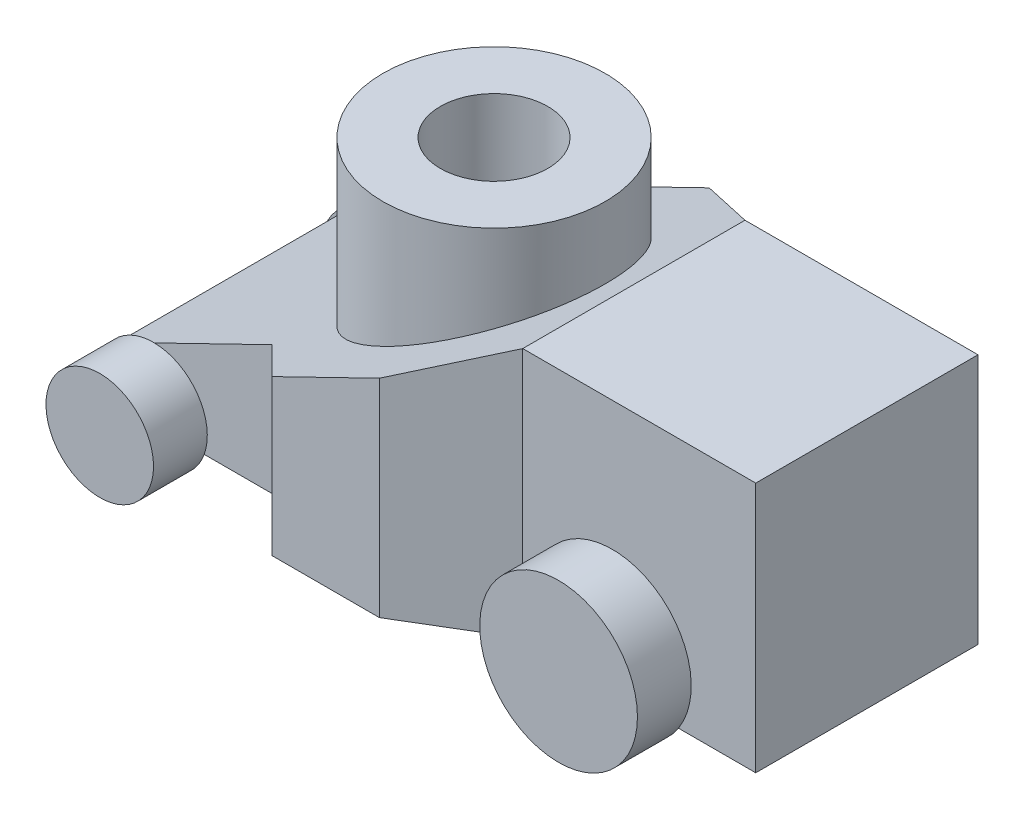
ISO-10303-21;
HEADER;
FILE_DESCRIPTION(('STEP AP214'),'2;1');
FILE_NAME('part.step','',(''),(''),'','','');
FILE_SCHEMA(('AUTOMOTIVE_DESIGN { 1 0 10303 214 1 1 1 1 }'));
ENDSEC;
DATA;
#1=APPLICATION_CONTEXT('core data for automotive mechanical design processes');
#2=APPLICATION_PROTOCOL_DEFINITION('international standard','automotive_design',2000,#1);
#3=PRODUCT_CONTEXT('',#1,'mechanical');
#4=PRODUCT('Part','Part','',(#3));
#5=PRODUCT_RELATED_PRODUCT_CATEGORY('part','',(#4));
#6=PRODUCT_DEFINITION_FORMATION('','',#4);
#7=PRODUCT_DEFINITION_CONTEXT('part definition',#1,'design');
#8=PRODUCT_DEFINITION('design','',#6,#7);
#9=PRODUCT_DEFINITION_SHAPE('','',#8);
#10=(LENGTH_UNIT() NAMED_UNIT(*) SI_UNIT(.MILLI.,.METRE.));
#11=(NAMED_UNIT(*) PLANE_ANGLE_UNIT() SI_UNIT($,.RADIAN.));
#12=(NAMED_UNIT(*) SI_UNIT($,.STERADIAN.) SOLID_ANGLE_UNIT());
#13=UNCERTAINTY_MEASURE_WITH_UNIT(LENGTH_MEASURE(1.E-05),#10,'distance_accuracy_value','');
#14=(GEOMETRIC_REPRESENTATION_CONTEXT(3) GLOBAL_UNCERTAINTY_ASSIGNED_CONTEXT((#13)) GLOBAL_UNIT_ASSIGNED_CONTEXT((#10,
#11,#12)) REPRESENTATION_CONTEXT('',''));
#15=CARTESIAN_POINT('',(0.,0.,0.));
#16=DIRECTION('',(0.,0.,1.));
#17=DIRECTION('',(1.,0.,0.));
#18=AXIS2_PLACEMENT_3D('',#15,#16,#17);
#19=CARTESIAN_POINT('',(178.,70.,31.));
#20=DIRECTION('',(0.,0.,-1.));
#21=DIRECTION('',(-1.,0.,0.));
#22=AXIS2_PLACEMENT_3D('',#19,#20,#21);
#23=PLANE('',#22);
#24=CARTESIAN_POINT('',(138.,12.,31.));
#25=DIRECTION('',(0.,0.,1.));
#26=DIRECTION('',(1.,0.,0.));
#27=AXIS2_PLACEMENT_3D('',#24,#25,#26);
#28=CIRCLE('',#27,22.);
#29=CARTESIAN_POINT('',(156.439088914586,0.,31.));
#30=VERTEX_POINT('',#29);
#31=CARTESIAN_POINT('',(119.560911085414,0.,31.));
#32=VERTEX_POINT('',#31);
#33=EDGE_CURVE('E180',#30,#32,#28,.T.);
#34=ORIENTED_EDGE('',*,*,#33,.F.);
#35=DIRECTION('',(1.,0.,0.));
#36=VECTOR('',#35,1.);
#37=CARTESIAN_POINT('',(178.,0.,31.));
#38=LINE('',#37,#36);
#39=CARTESIAN_POINT('',(178.,0.,31.));
#40=VERTEX_POINT('',#39);
#41=EDGE_CURVE('E256',#30,#40,#38,.T.);
#42=ORIENTED_EDGE('',*,*,#41,.T.);
#43=DIRECTION('',(0.,-1.,0.));
#44=VECTOR('',#43,1.);
#45=CARTESIAN_POINT('',(178.,70.,31.));
#46=LINE('',#45,#44);
#47=CARTESIAN_POINT('',(178.,70.,31.));
#48=VERTEX_POINT('',#47);
#49=EDGE_CURVE('E263',#48,#40,#46,.T.);
#50=ORIENTED_EDGE('',*,*,#49,.F.);
#51=DIRECTION('',(1.,0.,0.));
#52=VECTOR('',#51,1.);
#53=CARTESIAN_POINT('',(178.,70.,31.));
#54=LINE('',#53,#52);
#55=CARTESIAN_POINT('',(113.,70.,31.));
#56=VERTEX_POINT('',#55);
#57=EDGE_CURVE('E226',#56,#48,#54,.T.);
#58=ORIENTED_EDGE('',*,*,#57,.F.);
#59=DIRECTION('',(0.,-1.,0.));
#60=VECTOR('',#59,1.);
#61=CARTESIAN_POINT('',(113.,70.,31.));
#62=LINE('',#61,#60);
#63=CARTESIAN_POINT('',(113.,0.,31.));
#64=VERTEX_POINT('',#63);
#65=EDGE_CURVE('E266',#56,#64,#62,.T.);
#66=ORIENTED_EDGE('',*,*,#65,.T.);
#67=EDGE_CURVE('E257',#64,#32,#38,.T.);
#68=ORIENTED_EDGE('',*,*,#67,.T.);
#69=EDGE_LOOP('',(#34,#42,#50,#58,#66,#68));
#70=FACE_BOUND('',#69,.T.);
#71=ADVANCED_FACE('F31',(#70),#23,.F.);
#72=CARTESIAN_POINT('',(43.,70.,31.));
#73=DIRECTION('',(0.,0.,-1.));
#74=DIRECTION('',(-1.,0.,0.));
#75=AXIS2_PLACEMENT_3D('',#72,#73,#74);
#76=PLANE('',#75);
#77=CARTESIAN_POINT('',(10.,5.,31.));
#78=DIRECTION('',(0.,0.,1.));
#79=DIRECTION('',(1.,0.,0.));
#80=AXIS2_PLACEMENT_3D('',#77,#78,#79);
#81=CIRCLE('',#80,15.);
#82=CARTESIAN_POINT('',(24.142135623731,0.,31.));
#83=VERTEX_POINT('',#82);
#84=CARTESIAN_POINT('',(10.2678148206377,19.9976089834962,31.));
#85=VERTEX_POINT('',#84);
#86=EDGE_CURVE('E184',#83,#85,#81,.T.);
#87=ORIENTED_EDGE('',*,*,#86,.F.);
#88=DIRECTION('',(1.,0.,0.));
#89=VECTOR('',#88,1.);
#90=CARTESIAN_POINT('',(43.,0.,31.));
#91=LINE('',#90,#89);
#92=CARTESIAN_POINT('',(43.,0.,31.));
#93=VERTEX_POINT('',#92);
#94=EDGE_CURVE('E244',#83,#93,#91,.T.);
#95=ORIENTED_EDGE('',*,*,#94,.T.);
#96=DIRECTION('',(0.,-1.,0.));
#97=VECTOR('',#96,1.);
#98=CARTESIAN_POINT('',(43.,70.,31.));
#99=LINE('',#98,#97);
#100=CARTESIAN_POINT('',(43.,35.929203539823,31.));
#101=VERTEX_POINT('',#100);
#102=EDGE_CURVE('E273',#101,#93,#99,.T.);
#103=ORIENTED_EDGE('',*,*,#102,.F.);
#104=DIRECTION('',(0.899150472102885,0.437639610315564,0.));
#105=VECTOR('',#104,1.);
#106=CARTESIAN_POINT('',(56.4069899962011,42.4547296441687,31.));
#107=LINE('',#106,#105);
#108=EDGE_CURVE('E212',#85,#101,#107,.T.);
#109=ORIENTED_EDGE('',*,*,#108,.F.);
#110=EDGE_LOOP('',(#87,#95,#103,#109));
#111=FACE_BOUND('',#110,.T.);
#112=ADVANCED_FACE('F332',(#111),#76,.F.);
#113=CARTESIAN_POINT('',(113.,70.,101.));
#114=DIRECTION('',(-0.437639610315564,0.899150472102885,0.));
#115=DIRECTION('',(-0.899150472102885,-0.437639610315564,0.));
#116=AXIS2_PLACEMENT_3D('',#113,#114,#115);
#117=PLANE('',#116);
#118=DIRECTION('',(-0.791335930098313,-0.385163505800064,-0.474801558058988));
#119=VECTOR('',#118,1.);
#120=CARTESIAN_POINT('',(113.,70.,-31.));
#121=LINE('',#120,#119);
#122=CARTESIAN_POINT('',(113.,70.,-31.));
#123=VERTEX_POINT('',#122);
#124=CARTESIAN_POINT('',(88.,57.8318584070797,-46.));
#125=VERTEX_POINT('',#124);
#126=EDGE_CURVE('E154',#123,#125,#121,.T.);
#127=ORIENTED_EDGE('',*,*,#126,.T.);
#128=DIRECTION('',(-0.899150472102885,-0.437639610315564,0.));
#129=VECTOR('',#128,1.);
#130=CARTESIAN_POINT('',(92.7882107129289,60.162403444346,-46.));
#131=LINE('',#130,#129);
#132=CARTESIAN_POINT('',(58.,43.2300884955752,-46.));
#133=VERTEX_POINT('',#132);
#134=EDGE_CURVE('E220',#125,#133,#131,.T.);
#135=ORIENTED_EDGE('',*,*,#134,.T.);
#136=DIRECTION('',(-0.668615643572041,-0.325432392889047,0.668615643572041));
#137=VECTOR('',#136,1.);
#138=CARTESIAN_POINT('',(63.824843328782,46.0651892308231,-51.824843328782));
#139=LINE('',#138,#137);
#140=CARTESIAN_POINT('',(43.,35.929203539823,-31.));
#141=VERTEX_POINT('',#140);
#142=EDGE_CURVE('E218',#133,#141,#139,.T.);
#143=ORIENTED_EDGE('',*,*,#142,.T.);
#144=DIRECTION('',(-0.899150472102885,-0.437639610315564,0.));
#145=VECTOR('',#144,1.);
#146=CARTESIAN_POINT('',(56.4069899962011,42.4547296441687,-31.));
#147=LINE('',#146,#145);
#148=CARTESIAN_POINT('',(10.2678148206377,19.9976089834962,-31.));
#149=VERTEX_POINT('',#148);
#150=EDGE_CURVE('E216',#141,#149,#147,.T.);
#151=ORIENTED_EDGE('',*,*,#150,.T.);
#152=DIRECTION('',(-0.899150472102885,-0.437639610315564,0.));
#153=VECTOR('',#152,1.);
#154=CARTESIAN_POINT('',(113.,70.,-31.));
#155=LINE('',#154,#153);
#156=CARTESIAN_POINT('',(0.,15.,-31.));
#157=VERTEX_POINT('',#156);
#158=EDGE_CURVE('E175',#149,#157,#155,.T.);
#159=ORIENTED_EDGE('',*,*,#158,.T.);
#160=DIRECTION('',(0.,0.,-1.));
#161=VECTOR('',#160,1.);
#162=CARTESIAN_POINT('',(0.,15.,101.));
#163=LINE('',#162,#161);
#164=CARTESIAN_POINT('',(0.,15.,31.));
#165=VERTEX_POINT('',#164);
#166=EDGE_CURVE('E203',#165,#157,#163,.T.);
#167=ORIENTED_EDGE('',*,*,#166,.F.);
#168=EDGE_CURVE('E213',#165,#85,#107,.T.);
#169=ORIENTED_EDGE('',*,*,#168,.T.);
#170=ORIENTED_EDGE('',*,*,#108,.T.);
#171=DIRECTION('',(0.668615643572041,0.325432392889047,0.668615643572041));
#172=VECTOR('',#171,1.);
#173=CARTESIAN_POINT('',(63.824843328782,46.0651892308231,51.824843328782));
#174=LINE('',#173,#172);
#175=CARTESIAN_POINT('',(58.,43.2300884955752,46.));
#176=VERTEX_POINT('',#175);
#177=EDGE_CURVE('E210',#101,#176,#174,.T.);
#178=ORIENTED_EDGE('',*,*,#177,.T.);
#179=DIRECTION('',(0.899150472102885,0.437639610315564,0.));
#180=VECTOR('',#179,1.);
#181=CARTESIAN_POINT('',(92.7882107129289,60.162403444346,46.));
#182=LINE('',#181,#180);
#183=CARTESIAN_POINT('',(88.,57.8318584070797,46.));
#184=VERTEX_POINT('',#183);
#185=EDGE_CURVE('E208',#176,#184,#182,.T.);
#186=ORIENTED_EDGE('',*,*,#185,.T.);
#187=DIRECTION('',(0.791335930098313,0.385163505800064,-0.474801558058988));
#188=VECTOR('',#187,1.);
#189=CARTESIAN_POINT('',(113.,70.,31.));
#190=LINE('',#189,#188);
#191=EDGE_CURVE('E206',#184,#56,#190,.T.);
#192=ORIENTED_EDGE('',*,*,#191,.T.);
#193=DIRECTION('',(0.,0.,-1.));
#194=VECTOR('',#193,1.);
#195=CARTESIAN_POINT('',(113.,70.,-31.));
#196=LINE('',#195,#194);
#197=EDGE_CURVE('E11',#56,#123,#196,.T.);
#198=ORIENTED_EDGE('',*,*,#197,.T.);
#199=EDGE_LOOP('',(#127,#135,#143,#151,#159,#167,#169,#170,#178,#186,#192,#198));
#200=FACE_BOUND('',#199,.T.);
#201=CARTESIAN_POINT('',(74.,51.0176991150443,0.));
#202=DIRECTION('',(-0.437639610315564,0.899150472102885,0.));
#203=DIRECTION('',(-0.899150472102885,-0.437639610315564,0.));
#204=AXIS2_PLACEMENT_3D('',#201,#202,#203);
#205=ELLIPSE('',#204,34.4769879589773,31.);
#206=CARTESIAN_POINT('',(43.,35.929203539823,0.));
#207=VERTEX_POINT('',#206);
#208=EDGE_CURVE('E35',#207,#207,#205,.F.);
#209=ORIENTED_EDGE('',*,*,#208,.T.);
#210=EDGE_LOOP('',(#209));
#211=FACE_BOUND('',#210,.T.);
#212=ADVANCED_FACE('F337',(#200,#211),#117,.T.);
#213=CARTESIAN_POINT('',(113.,70.,-31.));
#214=DIRECTION('',(-0.514495755427527,0.,0.857492925712544));
#215=DIRECTION('',(0.857492925712544,0.,0.514495755427527));
#216=AXIS2_PLACEMENT_3D('',#213,#214,#215);
#217=PLANE('',#216);
#218=ORIENTED_EDGE('',*,*,#126,.F.);
#219=DIRECTION('',(0.,-1.,0.));
#220=VECTOR('',#219,1.);
#221=CARTESIAN_POINT('',(113.,70.,-31.));
#222=LINE('',#221,#220);
#223=CARTESIAN_POINT('',(113.,0.,-31.));
#224=VERTEX_POINT('',#223);
#225=EDGE_CURVE('E40',#123,#224,#222,.T.);
#226=ORIENTED_EDGE('',*,*,#225,.T.);
#227=DIRECTION('',(-0.857492925712544,0.,-0.514495755427527));
#228=VECTOR('',#227,1.);
#229=CARTESIAN_POINT('',(113.,0.,-31.));
#230=LINE('',#229,#228);
#231=CARTESIAN_POINT('',(88.,0.,-46.));
#232=VERTEX_POINT('',#231);
#233=EDGE_CURVE('E150',#224,#232,#230,.T.);
#234=ORIENTED_EDGE('',*,*,#233,.T.);
#235=DIRECTION('',(0.,-1.,0.));
#236=VECTOR('',#235,1.);
#237=CARTESIAN_POINT('',(88.,70.,-46.));
#238=LINE('',#237,#236);
#239=EDGE_CURVE('E286',#125,#232,#238,.T.);
#240=ORIENTED_EDGE('',*,*,#239,.F.);
#241=EDGE_LOOP('',(#218,#226,#234,#240));
#242=FACE_BOUND('',#241,.T.);
#243=ADVANCED_FACE('F290',(#242),#217,.F.);
#244=CARTESIAN_POINT('',(88.,70.,-46.));
#245=DIRECTION('',(0.,0.,1.));
#246=DIRECTION('',(1.,0.,0.));
#247=AXIS2_PLACEMENT_3D('',#244,#245,#246);
#248=PLANE('',#247);
#249=ORIENTED_EDGE('',*,*,#134,.F.);
#250=ORIENTED_EDGE('',*,*,#239,.T.);
#251=DIRECTION('',(-1.,0.,0.));
#252=VECTOR('',#251,1.);
#253=CARTESIAN_POINT('',(88.,0.,-46.));
#254=LINE('',#253,#252);
#255=CARTESIAN_POINT('',(58.,0.,-46.));
#256=VERTEX_POINT('',#255);
#257=EDGE_CURVE('E233',#232,#256,#254,.T.);
#258=ORIENTED_EDGE('',*,*,#257,.T.);
#259=DIRECTION('',(0.,-1.,0.));
#260=VECTOR('',#259,1.);
#261=CARTESIAN_POINT('',(58.,70.,-46.));
#262=LINE('',#261,#260);
#263=EDGE_CURVE('E284',#133,#256,#262,.T.);
#264=ORIENTED_EDGE('',*,*,#263,.F.);
#265=EDGE_LOOP('',(#249,#250,#258,#264));
#266=FACE_BOUND('',#265,.T.);
#267=ADVANCED_FACE('F365',(#266),#248,.F.);
#268=CARTESIAN_POINT('',(58.,70.,-46.));
#269=DIRECTION('',(0.707106781186548,0.,0.707106781186548));
#270=DIRECTION('',(0.707106781186548,0.,-0.707106781186548));
#271=AXIS2_PLACEMENT_3D('',#268,#269,#270);
#272=PLANE('',#271);
#273=ORIENTED_EDGE('',*,*,#142,.F.);
#274=ORIENTED_EDGE('',*,*,#263,.T.);
#275=DIRECTION('',(-0.707106781186547,0.,0.707106781186547));
#276=VECTOR('',#275,1.);
#277=CARTESIAN_POINT('',(58.,0.,-46.));
#278=LINE('',#277,#276);
#279=CARTESIAN_POINT('',(43.,0.,-31.));
#280=VERTEX_POINT('',#279);
#281=EDGE_CURVE('E236',#256,#280,#278,.T.);
#282=ORIENTED_EDGE('',*,*,#281,.T.);
#283=DIRECTION('',(0.,-1.,0.));
#284=VECTOR('',#283,1.);
#285=CARTESIAN_POINT('',(43.,70.,-31.));
#286=LINE('',#285,#284);
#287=EDGE_CURVE('E282',#141,#280,#286,.T.);
#288=ORIENTED_EDGE('',*,*,#287,.F.);
#289=EDGE_LOOP('',(#273,#274,#282,#288));
#290=FACE_BOUND('',#289,.T.);
#291=ADVANCED_FACE('F362',(#290),#272,.F.);
#292=CARTESIAN_POINT('',(43.,70.,-31.));
#293=DIRECTION('',(0.,0.,1.));
#294=DIRECTION('',(1.,0.,0.));
#295=AXIS2_PLACEMENT_3D('',#292,#293,#294);
#296=PLANE('',#295);
#297=DIRECTION('',(-1.,0.,0.));
#298=VECTOR('',#297,1.);
#299=CARTESIAN_POINT('',(43.,0.,-31.));
#300=LINE('',#299,#298);
#301=CARTESIAN_POINT('',(24.142135623731,0.,-31.));
#302=VERTEX_POINT('',#301);
#303=EDGE_CURVE('E240',#280,#302,#300,.T.);
#304=ORIENTED_EDGE('',*,*,#303,.T.);
#305=CARTESIAN_POINT('',(10.,5.,-31.));
#306=DIRECTION('',(0.,0.,1.));
#307=DIRECTION('',(1.,0.,0.));
#308=AXIS2_PLACEMENT_3D('',#305,#306,#307);
#309=CIRCLE('',#308,15.);
#310=EDGE_CURVE('E55',#302,#149,#309,.T.);
#311=ORIENTED_EDGE('',*,*,#310,.T.);
#312=ORIENTED_EDGE('',*,*,#150,.F.);
#313=ORIENTED_EDGE('',*,*,#287,.T.);
#314=EDGE_LOOP('',(#304,#311,#312,#313));
#315=FACE_BOUND('',#314,.T.);
#316=ADVANCED_FACE('F358',(#315),#296,.F.);
#317=CARTESIAN_POINT('',(0.,70.,31.));
#318=DIRECTION('',(1.,0.,0.));
#319=DIRECTION('',(0.,0.,-1.));
#320=AXIS2_PLACEMENT_3D('',#317,#318,#319);
#321=PLANE('',#320);
#322=ORIENTED_EDGE('',*,*,#166,.T.);
#323=DIRECTION('',(0.,-1.,0.));
#324=VECTOR('',#323,1.);
#325=CARTESIAN_POINT('',(0.,70.,-31.));
#326=LINE('',#325,#324);
#327=CARTESIAN_POINT('',(0.,0.,-31.));
#328=VERTEX_POINT('',#327);
#329=EDGE_CURVE('E279',#157,#328,#326,.T.);
#330=ORIENTED_EDGE('',*,*,#329,.T.);
#331=DIRECTION('',(0.,0.,1.));
#332=VECTOR('',#331,1.);
#333=CARTESIAN_POINT('',(0.,0.,31.));
#334=LINE('',#333,#332);
#335=CARTESIAN_POINT('',(0.,0.,31.));
#336=VERTEX_POINT('',#335);
#337=EDGE_CURVE('E242',#328,#336,#334,.T.);
#338=ORIENTED_EDGE('',*,*,#337,.T.);
#339=DIRECTION('',(0.,-1.,0.));
#340=VECTOR('',#339,1.);
#341=CARTESIAN_POINT('',(0.,70.,31.));
#342=LINE('',#341,#340);
#343=EDGE_CURVE('E276',#165,#336,#342,.T.);
#344=ORIENTED_EDGE('',*,*,#343,.F.);
#345=EDGE_LOOP('',(#322,#330,#338,#344));
#346=FACE_BOUND('',#345,.T.);
#347=ADVANCED_FACE('F353',(#346),#321,.F.);
#348=CARTESIAN_POINT('',(58.,70.,46.));
#349=DIRECTION('',(0.707106781186548,0.,-0.707106781186548));
#350=DIRECTION('',(-0.707106781186548,0.,-0.707106781186548));
#351=AXIS2_PLACEMENT_3D('',#348,#349,#350);
#352=PLANE('',#351);
#353=ORIENTED_EDGE('',*,*,#177,.F.);
#354=ORIENTED_EDGE('',*,*,#102,.T.);
#355=DIRECTION('',(0.707106781186547,0.,0.707106781186547));
#356=VECTOR('',#355,1.);
#357=CARTESIAN_POINT('',(58.,0.,46.));
#358=LINE('',#357,#356);
#359=CARTESIAN_POINT('',(58.,0.,46.));
#360=VERTEX_POINT('',#359);
#361=EDGE_CURVE('E248',#93,#360,#358,.T.);
#362=ORIENTED_EDGE('',*,*,#361,.T.);
#363=DIRECTION('',(0.,-1.,0.));
#364=VECTOR('',#363,1.);
#365=CARTESIAN_POINT('',(58.,70.,46.));
#366=LINE('',#365,#364);
#367=EDGE_CURVE('E271',#176,#360,#366,.T.);
#368=ORIENTED_EDGE('',*,*,#367,.F.);
#369=EDGE_LOOP('',(#353,#354,#362,#368));
#370=FACE_BOUND('',#369,.T.);
#371=ADVANCED_FACE('F350',(#370),#352,.F.);
#372=CARTESIAN_POINT('',(88.,70.,46.));
#373=DIRECTION('',(0.,0.,-1.));
#374=DIRECTION('',(-1.,0.,0.));
#375=AXIS2_PLACEMENT_3D('',#372,#373,#374);
#376=PLANE('',#375);
#377=ORIENTED_EDGE('',*,*,#185,.F.);
#378=ORIENTED_EDGE('',*,*,#367,.T.);
#379=DIRECTION('',(1.,0.,0.));
#380=VECTOR('',#379,1.);
#381=CARTESIAN_POINT('',(88.,0.,46.));
#382=LINE('',#381,#380);
#383=CARTESIAN_POINT('',(88.,0.,46.));
#384=VERTEX_POINT('',#383);
#385=EDGE_CURVE('E251',#360,#384,#382,.T.);
#386=ORIENTED_EDGE('',*,*,#385,.T.);
#387=DIRECTION('',(0.,-1.,0.));
#388=VECTOR('',#387,1.);
#389=CARTESIAN_POINT('',(88.,70.,46.));
#390=LINE('',#389,#388);
#391=EDGE_CURVE('E269',#184,#384,#390,.T.);
#392=ORIENTED_EDGE('',*,*,#391,.F.);
#393=EDGE_LOOP('',(#377,#378,#386,#392));
#394=FACE_BOUND('',#393,.T.);
#395=ADVANCED_FACE('F346',(#394),#376,.F.);
#396=CARTESIAN_POINT('',(113.,70.,31.));
#397=DIRECTION('',(-0.514495755427527,0.,-0.857492925712544));
#398=DIRECTION('',(-0.857492925712544,0.,0.514495755427527));
#399=AXIS2_PLACEMENT_3D('',#396,#397,#398);
#400=PLANE('',#399);
#401=ORIENTED_EDGE('',*,*,#191,.F.);
#402=ORIENTED_EDGE('',*,*,#391,.T.);
#403=DIRECTION('',(0.857492925712544,0.,-0.514495755427527));
#404=VECTOR('',#403,1.);
#405=CARTESIAN_POINT('',(113.,0.,31.));
#406=LINE('',#405,#404);
#407=EDGE_CURVE('E254',#384,#64,#406,.T.);
#408=ORIENTED_EDGE('',*,*,#407,.T.);
#409=ORIENTED_EDGE('',*,*,#65,.F.);
#410=EDGE_LOOP('',(#401,#402,#408,#409));
#411=FACE_BOUND('',#410,.T.);
#412=ADVANCED_FACE('F343',(#411),#400,.F.);
#413=CARTESIAN_POINT('',(0.,70.,-31.));
#414=DIRECTION('',(0.,-1.,0.));
#415=DIRECTION('',(0.,0.,-1.));
#416=AXIS2_PLACEMENT_3D('',#413,#414,#415);
#417=PLANE('',#416);
#418=ORIENTED_EDGE('',*,*,#197,.F.);
#419=ORIENTED_EDGE('',*,*,#57,.T.);
#420=DIRECTION('',(0.,0.,-1.));
#421=VECTOR('',#420,1.);
#422=CARTESIAN_POINT('',(178.,70.,-31.));
#423=LINE('',#422,#421);
#424=CARTESIAN_POINT('',(178.,70.,-31.));
#425=VERTEX_POINT('',#424);
#426=EDGE_CURVE('E229',#48,#425,#423,.T.);
#427=ORIENTED_EDGE('',*,*,#426,.T.);
#428=DIRECTION('',(-1.,0.,0.));
#429=VECTOR('',#428,1.);
#430=CARTESIAN_POINT('',(178.,70.,-31.));
#431=LINE('',#430,#429);
#432=EDGE_CURVE('E223',#425,#123,#431,.T.);
#433=ORIENTED_EDGE('',*,*,#432,.T.);
#434=EDGE_LOOP('',(#418,#419,#427,#433));
#435=FACE_BOUND('',#434,.T.);
#436=ADVANCED_FACE('F296',(#435),#417,.F.);
#437=CARTESIAN_POINT('',(178.,70.,-31.));
#438=DIRECTION('',(0.,0.,1.));
#439=DIRECTION('',(1.,0.,0.));
#440=AXIS2_PLACEMENT_3D('',#437,#438,#439);
#441=PLANE('',#440);
#442=DIRECTION('',(-1.,0.,0.));
#443=VECTOR('',#442,1.);
#444=CARTESIAN_POINT('',(178.,0.,-31.));
#445=LINE('',#444,#443);
#446=CARTESIAN_POINT('',(178.,0.,-31.));
#447=VERTEX_POINT('',#446);
#448=CARTESIAN_POINT('',(156.439088914586,0.,-31.));
#449=VERTEX_POINT('',#448);
#450=EDGE_CURVE('E156',#447,#449,#445,.T.);
#451=ORIENTED_EDGE('',*,*,#450,.T.);
#452=CARTESIAN_POINT('',(138.,12.,-31.));
#453=DIRECTION('',(0.,0.,1.));
#454=DIRECTION('',(1.,0.,0.));
#455=AXIS2_PLACEMENT_3D('',#452,#453,#454);
#456=CIRCLE('',#455,22.);
#457=CARTESIAN_POINT('',(119.560911085414,0.,-31.));
#458=VERTEX_POINT('',#457);
#459=EDGE_CURVE('E158',#449,#458,#456,.T.);
#460=ORIENTED_EDGE('',*,*,#459,.T.);
#461=EDGE_CURVE('E145',#458,#224,#445,.T.);
#462=ORIENTED_EDGE('',*,*,#461,.T.);
#463=ORIENTED_EDGE('',*,*,#225,.F.);
#464=ORIENTED_EDGE('',*,*,#432,.F.);
#465=DIRECTION('',(0.,-1.,0.));
#466=VECTOR('',#465,1.);
#467=CARTESIAN_POINT('',(178.,70.,-31.));
#468=LINE('',#467,#466);
#469=EDGE_CURVE('E230',#425,#447,#468,.T.);
#470=ORIENTED_EDGE('',*,*,#469,.T.);
#471=EDGE_LOOP('',(#451,#460,#462,#463,#464,#470));
#472=FACE_BOUND('',#471,.T.);
#473=ADVANCED_FACE('F33',(#472),#441,.F.);
#474=CARTESIAN_POINT('',(178.,70.,-31.));
#475=DIRECTION('',(-1.,0.,0.));
#476=DIRECTION('',(0.,0.,1.));
#477=AXIS2_PLACEMENT_3D('',#474,#475,#476);
#478=PLANE('',#477);
#479=DIRECTION('',(0.,0.,-1.));
#480=VECTOR('',#479,1.);
#481=CARTESIAN_POINT('',(178.,0.,-31.));
#482=LINE('',#481,#480);
#483=EDGE_CURVE('E227',#40,#447,#482,.T.);
#484=ORIENTED_EDGE('',*,*,#483,.T.);
#485=ORIENTED_EDGE('',*,*,#469,.F.);
#486=ORIENTED_EDGE('',*,*,#426,.F.);
#487=ORIENTED_EDGE('',*,*,#49,.T.);
#488=EDGE_LOOP('',(#484,#485,#486,#487));
#489=FACE_BOUND('',#488,.T.);
#490=ADVANCED_FACE('F302',(#489),#478,.F.);
#491=CARTESIAN_POINT('',(0.,0.,-31.));
#492=DIRECTION('',(0.,-1.,0.));
#493=DIRECTION('',(0.,0.,-1.));
#494=AXIS2_PLACEMENT_3D('',#491,#492,#493);
#495=PLANE('',#494);
#496=ORIENTED_EDGE('',*,*,#450,.F.);
#497=ORIENTED_EDGE('',*,*,#483,.F.);
#498=ORIENTED_EDGE('',*,*,#41,.F.);
#499=EDGE_CURVE('E260',#32,#30,#38,.T.);
#500=ORIENTED_EDGE('',*,*,#499,.F.);
#501=ORIENTED_EDGE('',*,*,#67,.F.);
#502=ORIENTED_EDGE('',*,*,#407,.F.);
#503=ORIENTED_EDGE('',*,*,#385,.F.);
#504=ORIENTED_EDGE('',*,*,#361,.F.);
#505=ORIENTED_EDGE('',*,*,#94,.F.);
#506=EDGE_CURVE('E245',#336,#83,#91,.T.);
#507=ORIENTED_EDGE('',*,*,#506,.F.);
#508=ORIENTED_EDGE('',*,*,#337,.F.);
#509=EDGE_CURVE('E239',#302,#328,#300,.T.);
#510=ORIENTED_EDGE('',*,*,#509,.F.);
#511=ORIENTED_EDGE('',*,*,#303,.F.);
#512=ORIENTED_EDGE('',*,*,#281,.F.);
#513=ORIENTED_EDGE('',*,*,#257,.F.);
#514=ORIENTED_EDGE('',*,*,#233,.F.);
#515=ORIENTED_EDGE('',*,*,#461,.F.);
#516=EDGE_CURVE('E47',#449,#458,#445,.T.);
#517=ORIENTED_EDGE('',*,*,#516,.F.);
#518=EDGE_LOOP('',(#496,#497,#498,#500,#501,#502,#503,#504,#505,#507,#508,#510,#511,#512,#513,
#514,#515,#517));
#519=FACE_BOUND('',#518,.T.);
#520=ADVANCED_FACE('F147',(#519),#495,.T.);
#521=CARTESIAN_POINT('',(74.,86.,0.));
#522=DIRECTION('',(0.,-1.,0.));
#523=DIRECTION('',(0.,0.,-1.));
#524=AXIS2_PLACEMENT_3D('',#521,#522,#523);
#525=CYLINDRICAL_SURFACE('',#524,31.);
#526=ORIENTED_EDGE('',*,*,#208,.F.);
#527=EDGE_LOOP('',(#526));
#528=FACE_BOUND('',#527,.T.);
#529=CARTESIAN_POINT('',(74.,86.,0.));
#530=DIRECTION('',(0.,1.,0.));
#531=DIRECTION('',(0.,0.,1.));
#532=AXIS2_PLACEMENT_3D('',#529,#530,#531);
#533=CIRCLE('',#532,31.);
#534=CARTESIAN_POINT('',(74.,86.,31.));
#535=VERTEX_POINT('',#534);
#536=EDGE_CURVE('E200',#535,#535,#533,.T.);
#537=ORIENTED_EDGE('',*,*,#536,.F.);
#538=EDGE_LOOP('',(#537));
#539=FACE_BOUND('',#538,.T.);
#540=ADVANCED_FACE('F380',(#528,#539),#525,.T.);
#541=CARTESIAN_POINT('',(74.,86.,0.));
#542=DIRECTION('',(0.,1.,0.));
#543=DIRECTION('',(0.,0.,1.));
#544=AXIS2_PLACEMENT_3D('',#541,#542,#543);
#545=PLANE('',#544);
#546=CARTESIAN_POINT('',(74.,86.,0.));
#547=DIRECTION('',(0.,1.,0.));
#548=DIRECTION('',(0.,0.,1.));
#549=AXIS2_PLACEMENT_3D('',#546,#547,#548);
#550=CIRCLE('',#549,15.);
#551=CARTESIAN_POINT('',(74.,86.,15.));
#552=VERTEX_POINT('',#551);
#553=EDGE_CURVE('E191',#552,#552,#550,.T.);
#554=ORIENTED_EDGE('',*,*,#553,.F.);
#555=EDGE_LOOP('',(#554));
#556=FACE_BOUND('',#555,.T.);
#557=ORIENTED_EDGE('',*,*,#536,.T.);
#558=EDGE_LOOP('',(#557));
#559=FACE_BOUND('',#558,.T.);
#560=ADVANCED_FACE('F388',(#556,#559),#545,.T.);
#561=CARTESIAN_POINT('',(74.,6.21200021427379,0.));
#562=DIRECTION('',(0.,1.,0.));
#563=DIRECTION('',(0.,0.,1.));
#564=AXIS2_PLACEMENT_3D('',#561,#562,#563);
#565=CYLINDRICAL_SURFACE('',#564,15.);
#566=CARTESIAN_POINT('',(74.,51.0176991150443,0.));
#567=DIRECTION('',(-0.437639610315564,0.899150472102885,0.));
#568=DIRECTION('',(0.899150472102885,0.437639610315564,0.));
#569=AXIS2_PLACEMENT_3D('',#566,#567,#568);
#570=ELLIPSE('',#569,16.6824135285374,15.);
#571=CARTESIAN_POINT('',(89.,58.3185840707965,0.));
#572=VERTEX_POINT('',#571);
#573=EDGE_CURVE('E197',#572,#572,#570,.F.);
#574=ORIENTED_EDGE('',*,*,#573,.T.);
#575=EDGE_LOOP('',(#574));
#576=FACE_BOUND('',#575,.T.);
#577=ORIENTED_EDGE('',*,*,#553,.T.);
#578=EDGE_LOOP('',(#577));
#579=FACE_BOUND('',#578,.T.);
#580=ADVANCED_FACE('F573',(#576,#579),#565,.F.);
#581=CARTESIAN_POINT('',(113.,70.,101.));
#582=DIRECTION('',(-0.437639610315564,0.899150472102885,0.));
#583=DIRECTION('',(-0.899150472102885,-0.437639610315564,0.));
#584=AXIS2_PLACEMENT_3D('',#581,#582,#583);
#585=PLANE('',#584);
#586=ORIENTED_EDGE('',*,*,#573,.F.);
#587=EDGE_LOOP('',(#586));
#588=FACE_BOUND('',#587,.T.);
#589=ADVANCED_FACE('F553',(#588),#585,.T.);
#590=CARTESIAN_POINT('',(10.,5.,46.));
#591=DIRECTION('',(0.,0.,-1.));
#592=DIRECTION('',(-1.,0.,0.));
#593=AXIS2_PLACEMENT_3D('',#590,#591,#592);
#594=CYLINDRICAL_SURFACE('',#593,15.);
#595=CARTESIAN_POINT('',(10.,5.,46.));
#596=DIRECTION('',(0.,0.,1.));
#597=DIRECTION('',(1.,0.,0.));
#598=AXIS2_PLACEMENT_3D('',#595,#596,#597);
#599=CIRCLE('',#598,15.);
#600=CARTESIAN_POINT('',(25.,5.,46.));
#601=VERTEX_POINT('',#600);
#602=EDGE_CURVE('E188',#601,#601,#599,.T.);
#603=ORIENTED_EDGE('',*,*,#602,.F.);
#604=EDGE_LOOP('',(#603));
#605=FACE_BOUND('',#604,.T.);
#606=EDGE_CURVE('E192',#85,#83,#81,.T.);
#607=ORIENTED_EDGE('',*,*,#606,.T.);
#608=ORIENTED_EDGE('',*,*,#86,.T.);
#609=EDGE_LOOP('',(#607,#608));
#610=FACE_BOUND('',#609,.T.);
#611=ADVANCED_FACE('F544',(#605,#610),#594,.T.);
#612=CARTESIAN_POINT('',(10.,5.,46.));
#613=DIRECTION('',(0.,0.,1.));
#614=DIRECTION('',(1.,0.,0.));
#615=AXIS2_PLACEMENT_3D('',#612,#613,#614);
#616=PLANE('',#615);
#617=ORIENTED_EDGE('',*,*,#602,.T.);
#618=EDGE_LOOP('',(#617));
#619=FACE_BOUND('',#618,.T.);
#620=ADVANCED_FACE('F325',(#619),#616,.T.);
#621=CARTESIAN_POINT('',(10.,5.,31.));
#622=DIRECTION('',(0.,0.,1.));
#623=DIRECTION('',(1.,0.,0.));
#624=AXIS2_PLACEMENT_3D('',#621,#622,#623);
#625=PLANE('',#624);
#626=ORIENTED_EDGE('',*,*,#168,.F.);
#627=ORIENTED_EDGE('',*,*,#343,.T.);
#628=ORIENTED_EDGE('',*,*,#506,.T.);
#629=ORIENTED_EDGE('',*,*,#606,.F.);
#630=EDGE_LOOP('',(#626,#627,#628,#629));
#631=FACE_BOUND('',#630,.T.);
#632=ADVANCED_FACE('F316',(#631),#625,.F.);
#633=CARTESIAN_POINT('',(138.,12.,46.));
#634=DIRECTION('',(0.,0.,-1.));
#635=DIRECTION('',(-1.,0.,0.));
#636=AXIS2_PLACEMENT_3D('',#633,#634,#635);
#637=CYLINDRICAL_SURFACE('',#636,22.);
#638=CARTESIAN_POINT('',(138.,12.,46.));
#639=DIRECTION('',(0.,0.,1.));
#640=DIRECTION('',(1.,0.,0.));
#641=AXIS2_PLACEMENT_3D('',#638,#639,#640);
#642=CIRCLE('',#641,22.);
#643=CARTESIAN_POINT('',(160.,12.,46.));
#644=VERTEX_POINT('',#643);
#645=EDGE_CURVE('E181',#644,#644,#642,.T.);
#646=ORIENTED_EDGE('',*,*,#645,.F.);
#647=EDGE_LOOP('',(#646));
#648=FACE_BOUND('',#647,.T.);
#649=EDGE_CURVE('E185',#32,#30,#28,.T.);
#650=ORIENTED_EDGE('',*,*,#649,.T.);
#651=ORIENTED_EDGE('',*,*,#33,.T.);
#652=EDGE_LOOP('',(#650,#651));
#653=FACE_BOUND('',#652,.T.);
#654=ADVANCED_FACE('F313',(#648,#653),#637,.T.);
#655=CARTESIAN_POINT('',(138.,12.,46.));
#656=DIRECTION('',(0.,0.,1.));
#657=DIRECTION('',(1.,0.,0.));
#658=AXIS2_PLACEMENT_3D('',#655,#656,#657);
#659=PLANE('',#658);
#660=ORIENTED_EDGE('',*,*,#645,.T.);
#661=EDGE_LOOP('',(#660));
#662=FACE_BOUND('',#661,.T.);
#663=ADVANCED_FACE('F315',(#662),#659,.T.);
#664=CARTESIAN_POINT('',(138.,12.,31.));
#665=DIRECTION('',(0.,0.,1.));
#666=DIRECTION('',(1.,0.,0.));
#667=AXIS2_PLACEMENT_3D('',#664,#665,#666);
#668=PLANE('',#667);
#669=ORIENTED_EDGE('',*,*,#499,.T.);
#670=ORIENTED_EDGE('',*,*,#649,.F.);
#671=EDGE_LOOP('',(#669,#670));
#672=FACE_BOUND('',#671,.T.);
#673=ADVANCED_FACE('F312',(#672),#668,.F.);
#674=CARTESIAN_POINT('',(10.,5.,-46.));
#675=DIRECTION('',(0.,0.,1.));
#676=DIRECTION('',(1.,0.,0.));
#677=AXIS2_PLACEMENT_3D('',#674,#675,#676);
#678=CYLINDRICAL_SURFACE('',#677,15.);
#679=CARTESIAN_POINT('',(10.,5.,-46.));
#680=DIRECTION('',(0.,0.,1.));
#681=DIRECTION('',(1.,0.,0.));
#682=AXIS2_PLACEMENT_3D('',#679,#680,#681);
#683=CIRCLE('',#682,15.);
#684=CARTESIAN_POINT('',(25.,5.,-46.));
#685=VERTEX_POINT('',#684);
#686=EDGE_CURVE('E172',#685,#685,#683,.T.);
#687=ORIENTED_EDGE('',*,*,#686,.T.);
#688=EDGE_LOOP('',(#687));
#689=FACE_BOUND('',#688,.T.);
#690=EDGE_CURVE('E176',#149,#302,#309,.T.);
#691=ORIENTED_EDGE('',*,*,#690,.F.);
#692=ORIENTED_EDGE('',*,*,#310,.F.);
#693=EDGE_LOOP('',(#691,#692));
#694=FACE_BOUND('',#693,.T.);
#695=ADVANCED_FACE('F462',(#689,#694),#678,.T.);
#696=CARTESIAN_POINT('',(10.,5.,-46.));
#697=DIRECTION('',(0.,0.,-1.));
#698=DIRECTION('',(1.,0.,0.));
#699=AXIS2_PLACEMENT_3D('',#696,#697,#698);
#700=PLANE('',#699);
#701=ORIENTED_EDGE('',*,*,#686,.F.);
#702=EDGE_LOOP('',(#701));
#703=FACE_BOUND('',#702,.T.);
#704=ADVANCED_FACE('F467',(#703),#700,.T.);
#705=CARTESIAN_POINT('',(10.,5.,-31.));
#706=DIRECTION('',(0.,0.,-1.));
#707=DIRECTION('',(1.,0.,0.));
#708=AXIS2_PLACEMENT_3D('',#705,#706,#707);
#709=PLANE('',#708);
#710=ORIENTED_EDGE('',*,*,#158,.F.);
#711=ORIENTED_EDGE('',*,*,#690,.T.);
#712=ORIENTED_EDGE('',*,*,#509,.T.);
#713=ORIENTED_EDGE('',*,*,#329,.F.);
#714=EDGE_LOOP('',(#710,#711,#712,#713));
#715=FACE_BOUND('',#714,.T.);
#716=ADVANCED_FACE('F479',(#715),#709,.F.);
#717=CARTESIAN_POINT('',(138.,12.,-46.));
#718=DIRECTION('',(0.,0.,1.));
#719=DIRECTION('',(1.,0.,0.));
#720=AXIS2_PLACEMENT_3D('',#717,#718,#719);
#721=CYLINDRICAL_SURFACE('',#720,22.);
#722=CARTESIAN_POINT('',(138.,12.,-46.));
#723=DIRECTION('',(0.,0.,1.));
#724=DIRECTION('',(1.,0.,0.));
#725=AXIS2_PLACEMENT_3D('',#722,#723,#724);
#726=CIRCLE('',#725,22.);
#727=CARTESIAN_POINT('',(160.,12.,-46.));
#728=VERTEX_POINT('',#727);
#729=EDGE_CURVE('E168',#728,#728,#726,.T.);
#730=ORIENTED_EDGE('',*,*,#729,.T.);
#731=EDGE_LOOP('',(#730));
#732=FACE_BOUND('',#731,.T.);
#733=EDGE_CURVE('E163',#458,#449,#456,.T.);
#734=ORIENTED_EDGE('',*,*,#733,.F.);
#735=ORIENTED_EDGE('',*,*,#459,.F.);
#736=EDGE_LOOP('',(#734,#735));
#737=FACE_BOUND('',#736,.T.);
#738=ADVANCED_FACE('F167',(#732,#737),#721,.T.);
#739=CARTESIAN_POINT('',(138.,12.,-46.));
#740=DIRECTION('',(0.,0.,-1.));
#741=DIRECTION('',(1.,0.,0.));
#742=AXIS2_PLACEMENT_3D('',#739,#740,#741);
#743=PLANE('',#742);
#744=ORIENTED_EDGE('',*,*,#729,.F.);
#745=EDGE_LOOP('',(#744));
#746=FACE_BOUND('',#745,.T.);
#747=ADVANCED_FACE('F498',(#746),#743,.T.);
#748=CARTESIAN_POINT('',(138.,12.,-31.));
#749=DIRECTION('',(0.,0.,-1.));
#750=DIRECTION('',(1.,0.,0.));
#751=AXIS2_PLACEMENT_3D('',#748,#749,#750);
#752=PLANE('',#751);
#753=ORIENTED_EDGE('',*,*,#516,.T.);
#754=ORIENTED_EDGE('',*,*,#733,.T.);
#755=EDGE_LOOP('',(#753,#754));
#756=FACE_BOUND('',#755,.T.);
#757=ADVANCED_FACE('F166',(#756),#752,.F.);
#758=CLOSED_SHELL('',(#71,#112,#212,#243,#267,#291,#316,#347,#371,#395,#412,#436,#473,#490,#520,
#540,#560,#580,#589,#611,#620,#632,#654,#663,#673,#695,#704,#716,#738,#747,#757));
#759=MANIFOLD_SOLID_BREP('B2',#758);
#760=ADVANCED_BREP_SHAPE_REPRESENTATION('',(#18,#759),#14);
#761=SHAPE_DEFINITION_REPRESENTATION(#9,#760);
ENDSEC;
END-ISO-10303-21;
